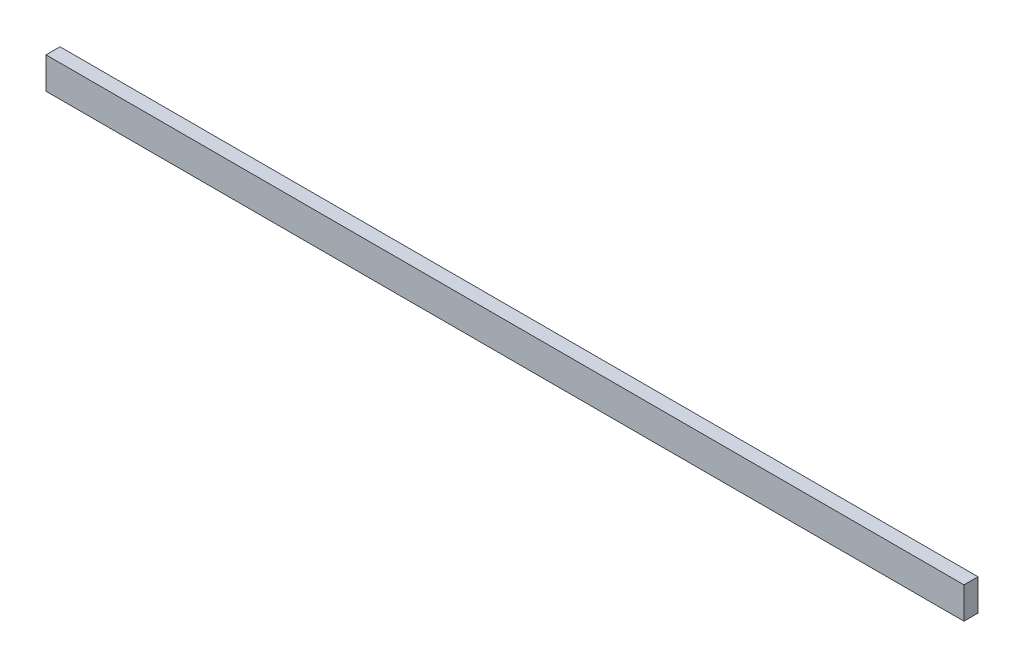
ISO-10303-21;
HEADER;
FILE_DESCRIPTION(('STEP AP214'),'2;1');
FILE_NAME('part.step','',(''),(''),'','','');
FILE_SCHEMA(('AUTOMOTIVE_DESIGN { 1 0 10303 214 1 1 1 1 }'));
ENDSEC;
DATA;
#1=APPLICATION_CONTEXT('core data for automotive mechanical design processes');
#2=APPLICATION_PROTOCOL_DEFINITION('international standard','automotive_design',2000,#1);
#3=PRODUCT_CONTEXT('',#1,'mechanical');
#4=PRODUCT('Part','Part','',(#3));
#5=PRODUCT_RELATED_PRODUCT_CATEGORY('part','',(#4));
#6=PRODUCT_DEFINITION_FORMATION('','',#4);
#7=PRODUCT_DEFINITION_CONTEXT('part definition',#1,'design');
#8=PRODUCT_DEFINITION('design','',#6,#7);
#9=PRODUCT_DEFINITION_SHAPE('','',#8);
#10=(LENGTH_UNIT() NAMED_UNIT(*) SI_UNIT(.MILLI.,.METRE.));
#11=(NAMED_UNIT(*) PLANE_ANGLE_UNIT() SI_UNIT($,.RADIAN.));
#12=(NAMED_UNIT(*) SI_UNIT($,.STERADIAN.) SOLID_ANGLE_UNIT());
#13=UNCERTAINTY_MEASURE_WITH_UNIT(LENGTH_MEASURE(1.E-05),#10,'distance_accuracy_value','');
#14=(GEOMETRIC_REPRESENTATION_CONTEXT(3) GLOBAL_UNCERTAINTY_ASSIGNED_CONTEXT((#13)) GLOBAL_UNIT_ASSIGNED_CONTEXT((#10,
#11,#12)) REPRESENTATION_CONTEXT('',''));
#15=CARTESIAN_POINT('',(0.,0.,0.));
#16=DIRECTION('',(0.,0.,1.));
#17=DIRECTION('',(1.,0.,0.));
#18=AXIS2_PLACEMENT_3D('',#15,#16,#17);
#19=CARTESIAN_POINT('',(-4.63769969700145,166.,-2.));
#20=DIRECTION('',(-1.,0.,0.));
#21=DIRECTION('',(0.,0.,1.));
#22=AXIS2_PLACEMENT_3D('',#19,#20,#21);
#23=PLANE('',#22);
#24=DIRECTION('',(0.,-1.,0.));
#25=VECTOR('',#24,1.);
#26=CARTESIAN_POINT('',(-4.63769969700145,166.,0.));
#27=LINE('',#26,#25);
#28=CARTESIAN_POINT('',(-4.63769969700145,170.5,0.));
#29=VERTEX_POINT('',#28);
#30=CARTESIAN_POINT('',(-4.63769969700145,166.,0.));
#31=VERTEX_POINT('',#30);
#32=EDGE_CURVE('E99',#29,#31,#27,.T.);
#33=ORIENTED_EDGE('',*,*,#32,.F.);
#34=DIRECTION('',(0.,0.,1.));
#35=VECTOR('',#34,1.);
#36=CARTESIAN_POINT('',(-4.63769969700145,170.5,-2.));
#37=LINE('',#36,#35);
#38=CARTESIAN_POINT('',(-4.63769969700145,170.5,-2.));
#39=VERTEX_POINT('',#38);
#40=EDGE_CURVE('E11',#39,#29,#37,.T.);
#41=ORIENTED_EDGE('',*,*,#40,.F.);
#42=DIRECTION('',(0.,-1.,0.));
#43=VECTOR('',#42,1.);
#44=CARTESIAN_POINT('',(-4.63769969700145,166.,-2.));
#45=LINE('',#44,#43);
#46=CARTESIAN_POINT('',(-4.63769969700145,166.,-2.));
#47=VERTEX_POINT('',#46);
#48=EDGE_CURVE('E93',#39,#47,#45,.T.);
#49=ORIENTED_EDGE('',*,*,#48,.T.);
#50=DIRECTION('',(0.,0.,1.));
#51=VECTOR('',#50,1.);
#52=CARTESIAN_POINT('',(-4.63769969700145,166.,-2.));
#53=LINE('',#52,#51);
#54=EDGE_CURVE('E38',#47,#31,#53,.T.);
#55=ORIENTED_EDGE('',*,*,#54,.T.);
#56=EDGE_LOOP('',(#33,#41,#49,#55));
#57=FACE_BOUND('',#56,.T.);
#58=ADVANCED_FACE('F35',(#57),#23,.T.);
#59=CARTESIAN_POINT('',(-4.63769969700145,170.5,-2.));
#60=DIRECTION('',(0.,1.,0.));
#61=DIRECTION('',(0.,0.,1.));
#62=AXIS2_PLACEMENT_3D('',#59,#60,#61);
#63=PLANE('',#62);
#64=DIRECTION('',(-1.,0.,0.));
#65=VECTOR('',#64,1.);
#66=CARTESIAN_POINT('',(-4.63769969700145,170.5,0.));
#67=LINE('',#66,#65);
#68=CARTESIAN_POINT('',(126.362300302999,170.5,0.));
#69=VERTEX_POINT('',#68);
#70=EDGE_CURVE('E95',#69,#29,#67,.T.);
#71=ORIENTED_EDGE('',*,*,#70,.F.);
#72=DIRECTION('',(0.,0.,1.));
#73=VECTOR('',#72,1.);
#74=CARTESIAN_POINT('',(126.362300302999,170.5,-2.));
#75=LINE('',#74,#73);
#76=CARTESIAN_POINT('',(126.362300302999,170.5,-2.));
#77=VERTEX_POINT('',#76);
#78=EDGE_CURVE('E44',#77,#69,#75,.T.);
#79=ORIENTED_EDGE('',*,*,#78,.F.);
#80=DIRECTION('',(-1.,0.,0.));
#81=VECTOR('',#80,1.);
#82=CARTESIAN_POINT('',(-4.63769969700145,170.5,-2.));
#83=LINE('',#82,#81);
#84=EDGE_CURVE('E90',#77,#39,#83,.T.);
#85=ORIENTED_EDGE('',*,*,#84,.T.);
#86=ORIENTED_EDGE('',*,*,#40,.T.);
#87=EDGE_LOOP('',(#71,#79,#85,#86));
#88=FACE_BOUND('',#87,.T.);
#89=ADVANCED_FACE('F109',(#88),#63,.T.);
#90=CARTESIAN_POINT('',(126.362300302999,166.,-2.));
#91=DIRECTION('',(1.,0.,0.));
#92=DIRECTION('',(0.,0.,-1.));
#93=AXIS2_PLACEMENT_3D('',#90,#91,#92);
#94=PLANE('',#93);
#95=DIRECTION('',(0.,1.,0.));
#96=VECTOR('',#95,1.);
#97=CARTESIAN_POINT('',(126.362300302999,166.,0.));
#98=LINE('',#97,#96);
#99=CARTESIAN_POINT('',(126.362300302999,166.,0.));
#100=VERTEX_POINT('',#99);
#101=EDGE_CURVE('E85',#100,#69,#98,.T.);
#102=ORIENTED_EDGE('',*,*,#101,.F.);
#103=DIRECTION('',(0.,0.,1.));
#104=VECTOR('',#103,1.);
#105=CARTESIAN_POINT('',(126.362300302999,166.,-2.));
#106=LINE('',#105,#104);
#107=CARTESIAN_POINT('',(126.362300302999,166.,-2.));
#108=VERTEX_POINT('',#107);
#109=EDGE_CURVE('E80',#108,#100,#106,.T.);
#110=ORIENTED_EDGE('',*,*,#109,.F.);
#111=DIRECTION('',(0.,1.,0.));
#112=VECTOR('',#111,1.);
#113=CARTESIAN_POINT('',(126.362300302999,166.,-2.));
#114=LINE('',#113,#112);
#115=EDGE_CURVE('E83',#108,#77,#114,.T.);
#116=ORIENTED_EDGE('',*,*,#115,.T.);
#117=ORIENTED_EDGE('',*,*,#78,.T.);
#118=EDGE_LOOP('',(#102,#110,#116,#117));
#119=FACE_BOUND('',#118,.T.);
#120=ADVANCED_FACE('F82',(#119),#94,.T.);
#121=CARTESIAN_POINT('',(-4.63769969700145,166.,-2.));
#122=DIRECTION('',(0.,-1.,0.));
#123=DIRECTION('',(0.,0.,-1.));
#124=AXIS2_PLACEMENT_3D('',#121,#122,#123);
#125=PLANE('',#124);
#126=DIRECTION('',(1.,0.,0.));
#127=VECTOR('',#126,1.);
#128=CARTESIAN_POINT('',(-4.63769969700145,166.,0.));
#129=LINE('',#128,#127);
#130=EDGE_CURVE('E102',#31,#100,#129,.T.);
#131=ORIENTED_EDGE('',*,*,#130,.F.);
#132=ORIENTED_EDGE('',*,*,#54,.F.);
#133=DIRECTION('',(1.,0.,0.));
#134=VECTOR('',#133,1.);
#135=CARTESIAN_POINT('',(-4.63769969700145,166.,-2.));
#136=LINE('',#135,#134);
#137=EDGE_CURVE('E89',#47,#108,#136,.T.);
#138=ORIENTED_EDGE('',*,*,#137,.T.);
#139=ORIENTED_EDGE('',*,*,#109,.T.);
#140=EDGE_LOOP('',(#131,#132,#138,#139));
#141=FACE_BOUND('',#140,.T.);
#142=ADVANCED_FACE('F92',(#141),#125,.T.);
#143=CARTESIAN_POINT('',(0.,0.,-2.));
#144=DIRECTION('',(0.,0.,-1.));
#145=DIRECTION('',(-1.,0.,0.));
#146=AXIS2_PLACEMENT_3D('',#143,#144,#145);
#147=PLANE('',#146);
#148=ORIENTED_EDGE('',*,*,#48,.F.);
#149=ORIENTED_EDGE('',*,*,#84,.F.);
#150=ORIENTED_EDGE('',*,*,#115,.F.);
#151=ORIENTED_EDGE('',*,*,#137,.F.);
#152=EDGE_LOOP('',(#148,#149,#150,#151));
#153=FACE_BOUND('',#152,.T.);
#154=ADVANCED_FACE('F88',(#153),#147,.T.);
#155=CARTESIAN_POINT('',(0.,0.,0.));
#156=DIRECTION('',(0.,0.,-1.));
#157=DIRECTION('',(-1.,0.,0.));
#158=AXIS2_PLACEMENT_3D('',#155,#156,#157);
#159=PLANE('',#158);
#160=ORIENTED_EDGE('',*,*,#32,.T.);
#161=ORIENTED_EDGE('',*,*,#130,.T.);
#162=ORIENTED_EDGE('',*,*,#101,.T.);
#163=ORIENTED_EDGE('',*,*,#70,.T.);
#164=EDGE_LOOP('',(#160,#161,#162,#163));
#165=FACE_BOUND('',#164,.T.);
#166=ADVANCED_FACE('F108',(#165),#159,.F.);
#167=CLOSED_SHELL('',(#58,#89,#120,#142,#154,#166));
#168=MANIFOLD_SOLID_BREP('B2',#167);
#169=ADVANCED_BREP_SHAPE_REPRESENTATION('',(#18,#168),#14);
#170=SHAPE_DEFINITION_REPRESENTATION(#9,#169);
ENDSEC;
END-ISO-10303-21;
